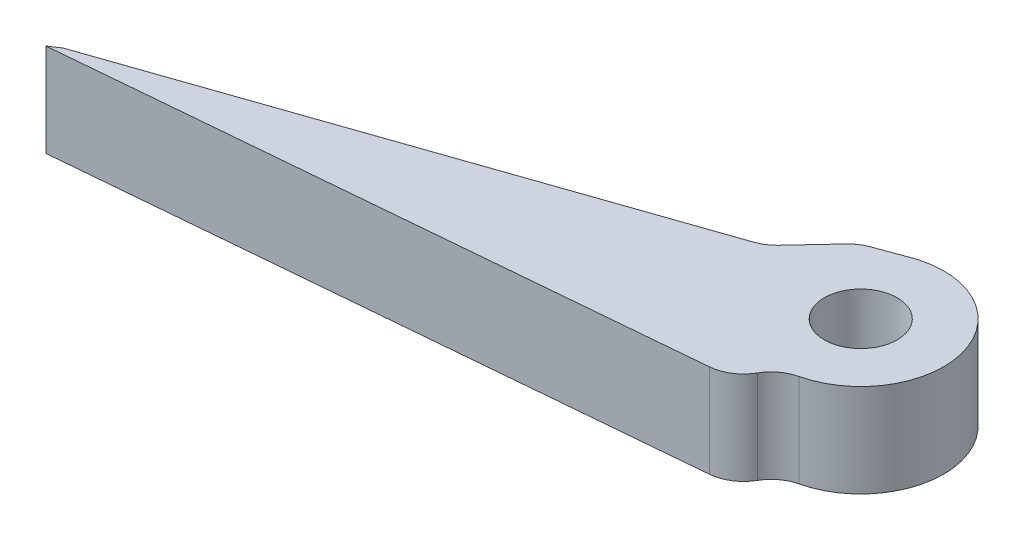
ISO-10303-21;
HEADER;
FILE_DESCRIPTION(('STEP AP214'),'2;1');
FILE_NAME('part.step','',(''),(''),'','','');
FILE_SCHEMA(('AUTOMOTIVE_DESIGN { 1 0 10303 214 1 1 1 1 }'));
ENDSEC;
DATA;
#1=APPLICATION_CONTEXT('core data for automotive mechanical design processes');
#2=APPLICATION_PROTOCOL_DEFINITION('international standard','automotive_design',2000,#1);
#3=PRODUCT_CONTEXT('',#1,'mechanical');
#4=PRODUCT('Part','Part','',(#3));
#5=PRODUCT_RELATED_PRODUCT_CATEGORY('part','',(#4));
#6=PRODUCT_DEFINITION_FORMATION('','',#4);
#7=PRODUCT_DEFINITION_CONTEXT('part definition',#1,'design');
#8=PRODUCT_DEFINITION('design','',#6,#7);
#9=PRODUCT_DEFINITION_SHAPE('','',#8);
#10=(LENGTH_UNIT() NAMED_UNIT(*) SI_UNIT(.MILLI.,.METRE.));
#11=(NAMED_UNIT(*) PLANE_ANGLE_UNIT() SI_UNIT($,.RADIAN.));
#12=(NAMED_UNIT(*) SI_UNIT($,.STERADIAN.) SOLID_ANGLE_UNIT());
#13=UNCERTAINTY_MEASURE_WITH_UNIT(LENGTH_MEASURE(1.E-05),#10,'distance_accuracy_value','');
#14=(GEOMETRIC_REPRESENTATION_CONTEXT(3) GLOBAL_UNCERTAINTY_ASSIGNED_CONTEXT((#13)) GLOBAL_UNIT_ASSIGNED_CONTEXT((#10,
#11,#12)) REPRESENTATION_CONTEXT('',''));
#15=CARTESIAN_POINT('',(0.,0.,0.));
#16=DIRECTION('',(0.,0.,1.));
#17=DIRECTION('',(1.,0.,0.));
#18=AXIS2_PLACEMENT_3D('',#15,#16,#17);
#19=CARTESIAN_POINT('',(0.,6.35,0.));
#20=DIRECTION('',(0.,-1.,0.));
#21=DIRECTION('',(0.,0.,-1.));
#22=AXIS2_PLACEMENT_3D('',#19,#20,#21);
#23=CYLINDRICAL_SURFACE('',#22,5.6642);
#24=CARTESIAN_POINT('',(0.,6.35,0.));
#25=DIRECTION('',(0.,1.,0.));
#26=DIRECTION('',(0.,0.,1.));
#27=AXIS2_PLACEMENT_3D('',#24,#25,#26);
#28=CIRCLE('',#27,5.6642);
#29=CARTESIAN_POINT('',(1.29689508505912,6.35,5.51373056816793));
#30=VERTEX_POINT('',#29);
#31=CARTESIAN_POINT('',(-1.48078407813982,6.35,-5.46721502722616));
#32=VERTEX_POINT('',#31);
#33=EDGE_CURVE('E190',#30,#32,#28,.T.);
#34=ORIENTED_EDGE('',*,*,#33,.F.);
#35=DIRECTION('',(0.,-1.,0.));
#36=VECTOR('',#35,1.);
#37=CARTESIAN_POINT('',(1.29689508505912,6.35,5.51373056816793));
#38=LINE('',#37,#36);
#39=CARTESIAN_POINT('',(1.29689508505912,0.,5.51373056816793));
#40=VERTEX_POINT('',#39);
#41=EDGE_CURVE('E240',#30,#40,#38,.T.);
#42=ORIENTED_EDGE('',*,*,#41,.T.);
#43=CARTESIAN_POINT('',(0.,0.,0.));
#44=DIRECTION('',(0.,1.,0.));
#45=DIRECTION('',(0.,0.,1.));
#46=AXIS2_PLACEMENT_3D('',#43,#44,#45);
#47=CIRCLE('',#46,5.6642);
#48=CARTESIAN_POINT('',(-1.48078407813982,0.,-5.46721502722616));
#49=VERTEX_POINT('',#48);
#50=EDGE_CURVE('E166',#40,#49,#47,.T.);
#51=ORIENTED_EDGE('',*,*,#50,.T.);
#52=DIRECTION('',(0.,-1.,0.));
#53=VECTOR('',#52,1.);
#54=CARTESIAN_POINT('',(-1.48078407813982,6.35,-5.46721502722616));
#55=LINE('',#54,#53);
#56=EDGE_CURVE('E221',#49,#32,#55,.F.);
#57=ORIENTED_EDGE('',*,*,#56,.T.);
#58=EDGE_LOOP('',(#34,#42,#51,#57));
#59=FACE_BOUND('',#58,.T.);
#60=ADVANCED_FACE('F42',(#59),#23,.T.);
#61=CARTESIAN_POINT('',(-1.93832585993717,6.35,-5.31007611663692));
#62=DIRECTION('',(0.342897302873058,0.,0.939372897034177));
#63=DIRECTION('',(0.939372897034177,0.,-0.342897302873058));
#64=AXIS2_PLACEMENT_3D('',#61,#62,#63);
#65=PLANE('',#64);
#66=DIRECTION('',(-0.939372897034177,0.,0.342897302873058));
#67=VECTOR('',#66,1.);
#68=CARTESIAN_POINT('',(-1.93832585993717,6.35,-5.31007611663692));
#69=LINE('',#68,#67);
#70=CARTESIAN_POINT('',(-1.68771449284554,6.35,-5.40155625420142));
#71=VERTEX_POINT('',#70);
#72=CARTESIAN_POINT('',(-3.93136501602205,6.35,-4.58256124655755));
#73=VERTEX_POINT('',#72);
#74=EDGE_CURVE('E261',#71,#73,#69,.T.);
#75=ORIENTED_EDGE('',*,*,#74,.F.);
#76=DIRECTION('',(0.,-1.,0.));
#77=VECTOR('',#76,1.);
#78=CARTESIAN_POINT('',(-1.68771449284554,6.35,-5.40155625420142));
#79=LINE('',#78,#77);
#80=CARTESIAN_POINT('',(-1.68771449284554,0.,-5.40155625420142));
#81=VERTEX_POINT('',#80);
#82=EDGE_CURVE('E217',#71,#81,#79,.T.);
#83=ORIENTED_EDGE('',*,*,#82,.T.);
#84=DIRECTION('',(-0.939372897034177,0.,0.342897302873058));
#85=VECTOR('',#84,1.);
#86=CARTESIAN_POINT('',(-1.93832585993717,0.,-5.31007611663692));
#87=LINE('',#86,#85);
#88=CARTESIAN_POINT('',(-3.93136501602205,0.,-4.58256124655755));
#89=VERTEX_POINT('',#88);
#90=EDGE_CURVE('E169',#81,#89,#87,.T.);
#91=ORIENTED_EDGE('',*,*,#90,.T.);
#92=DIRECTION('',(0.,-1.,0.));
#93=VECTOR('',#92,1.);
#94=CARTESIAN_POINT('',(-3.93136501602205,6.35,-4.58256124655755));
#95=LINE('',#94,#93);
#96=EDGE_CURVE('E214',#89,#73,#95,.F.);
#97=ORIENTED_EDGE('',*,*,#96,.T.);
#98=EDGE_LOOP('',(#75,#83,#91,#97));
#99=FACE_BOUND('',#98,.T.);
#100=ADVANCED_FACE('F264',(#99),#65,.F.);
#101=CARTESIAN_POINT('',(-4.58967507965529,6.35,-4.28088514702107));
#102=DIRECTION('',(0.731278684400195,0.,0.682078797311514));
#103=DIRECTION('',(0.682078797311514,0.,-0.731278684400195));
#104=AXIS2_PLACEMENT_3D('',#101,#102,#103);
#105=PLANE('',#104);
#106=DIRECTION('',(-0.682078797311514,0.,0.731278684400195));
#107=VECTOR('',#106,1.);
#108=CARTESIAN_POINT('',(-4.58967507965529,6.35,-4.28088514702107));
#109=LINE('',#108,#107);
#110=CARTESIAN_POINT('',(-4.91785372510097,6.35,-3.92903423326198));
#111=VERTEX_POINT('',#110);
#112=CARTESIAN_POINT('',(-7.13490656472734,6.35,-1.55206035546642));
#113=VERTEX_POINT('',#112);
#114=EDGE_CURVE('E139',#111,#113,#109,.T.);
#115=ORIENTED_EDGE('',*,*,#114,.F.);
#116=DIRECTION('',(0.,-1.,0.));
#117=VECTOR('',#116,1.);
#118=CARTESIAN_POINT('',(-4.91785372510097,6.35,-3.92903423326198));
#119=LINE('',#118,#117);
#120=CARTESIAN_POINT('',(-4.91785372510097,0.,-3.92903423326198));
#121=VERTEX_POINT('',#120);
#122=EDGE_CURVE('E228',#111,#121,#119,.T.);
#123=ORIENTED_EDGE('',*,*,#122,.T.);
#124=DIRECTION('',(-0.682078797311514,0.,0.731278684400195));
#125=VECTOR('',#124,1.);
#126=CARTESIAN_POINT('',(-4.58967507965529,0.,-4.28088514702107));
#127=LINE('',#126,#125);
#128=CARTESIAN_POINT('',(-7.13490656472734,0.,-1.55206035546642));
#129=VERTEX_POINT('',#128);
#130=EDGE_CURVE('E173',#121,#129,#127,.T.);
#131=ORIENTED_EDGE('',*,*,#130,.T.);
#132=DIRECTION('',(0.,-1.,0.));
#133=VECTOR('',#132,1.);
#134=CARTESIAN_POINT('',(-7.13490656472734,6.35,-1.55206035546642));
#135=LINE('',#134,#133);
#136=EDGE_CURVE('E225',#129,#113,#135,.F.);
#137=ORIENTED_EDGE('',*,*,#136,.T.);
#138=EDGE_LOOP('',(#115,#123,#131,#137));
#139=FACE_BOUND('',#138,.T.);
#140=ADVANCED_FACE('F293',(#139),#105,.F.);
#141=CARTESIAN_POINT('',(-1.14127849340694,6.35,-3.3070118596416));
#142=DIRECTION('',(0.326228149845985,0.,0.945291063243521));
#143=DIRECTION('',(0.945291063243521,0.,-0.326228149845985));
#144=AXIS2_PLACEMENT_3D('',#141,#142,#143);
#145=PLANE('',#144);
#146=DIRECTION('',(-0.945291063243521,0.,0.326228149845985));
#147=VECTOR('',#146,1.);
#148=CARTESIAN_POINT('',(-1.14127849340694,6.35,-3.3070118596416));
#149=LINE('',#148,#147);
#150=CARTESIAN_POINT('',(-8.16373492249503,6.35,-0.88350119999912));
#151=VERTEX_POINT('',#150);
#152=CARTESIAN_POINT('',(-43.2087752257035,6.35,11.2108463548856));
#153=VERTEX_POINT('',#152);
#154=EDGE_CURVE('E124',#151,#153,#149,.T.);
#155=ORIENTED_EDGE('',*,*,#154,.F.);
#156=DIRECTION('',(0.,-1.,0.));
#157=VECTOR('',#156,1.);
#158=CARTESIAN_POINT('',(-8.16373492249503,0.,-0.883501199999119));
#159=LINE('',#158,#157);
#160=CARTESIAN_POINT('',(-8.16373492249503,0.,-0.88350119999912));
#161=VERTEX_POINT('',#160);
#162=EDGE_CURVE('E232',#151,#161,#159,.T.);
#163=ORIENTED_EDGE('',*,*,#162,.T.);
#164=DIRECTION('',(-0.945291063243521,0.,0.326228149845985));
#165=VECTOR('',#164,1.);
#166=CARTESIAN_POINT('',(-1.14127849340694,0.,-3.3070118596416));
#167=LINE('',#166,#165);
#168=CARTESIAN_POINT('',(-43.2087752257035,0.,11.2108463548856));
#169=VERTEX_POINT('',#168);
#170=EDGE_CURVE('E145',#161,#169,#167,.T.);
#171=ORIENTED_EDGE('',*,*,#170,.T.);
#172=DIRECTION('',(0.,-1.,0.));
#173=VECTOR('',#172,1.);
#174=CARTESIAN_POINT('',(-43.2087752257035,6.35,11.2108463548856));
#175=LINE('',#174,#173);
#176=EDGE_CURVE('E142',#153,#169,#175,.T.);
#177=ORIENTED_EDGE('',*,*,#176,.F.);
#178=EDGE_LOOP('',(#155,#163,#171,#177));
#179=FACE_BOUND('',#178,.T.);
#180=ADVANCED_FACE('F143',(#179),#145,.F.);
#181=CARTESIAN_POINT('',(-8.12479474790291,6.35,-12.1842060856918));
#182=DIRECTION('',(0.554794299812511,0.,0.831987550925821));
#183=DIRECTION('',(0.831987550925821,0.,-0.554794299812511));
#184=AXIS2_PLACEMENT_3D('',#181,#182,#183);
#185=PLANE('',#184);
#186=DIRECTION('',(-0.831987550925821,0.,0.554794299812511));
#187=VECTOR('',#186,1.);
#188=CARTESIAN_POINT('',(-8.12479474790291,0.,-12.1842060856918));
#189=LINE('',#188,#187);
#190=CARTESIAN_POINT('',(-43.9079976591394,0.,11.6771088848232));
#191=VERTEX_POINT('',#190);
#192=EDGE_CURVE('E179',#169,#191,#189,.T.);
#193=ORIENTED_EDGE('',*,*,#192,.T.);
#194=DIRECTION('',(0.,-1.,0.));
#195=VECTOR('',#194,1.);
#196=CARTESIAN_POINT('',(-43.9079976591394,6.35,11.6771088848232));
#197=LINE('',#196,#195);
#198=CARTESIAN_POINT('',(-43.9079976591394,6.35,11.6771088848232));
#199=VERTEX_POINT('',#198);
#200=EDGE_CURVE('E150',#199,#191,#197,.T.);
#201=ORIENTED_EDGE('',*,*,#200,.F.);
#202=DIRECTION('',(-0.831987550925821,0.,0.554794299812511));
#203=VECTOR('',#202,1.);
#204=CARTESIAN_POINT('',(-8.12479474790291,6.35,-12.1842060856918));
#205=LINE('',#204,#203);
#206=EDGE_CURVE('E130',#153,#199,#205,.T.);
#207=ORIENTED_EDGE('',*,*,#206,.F.);
#208=ORIENTED_EDGE('',*,*,#176,.T.);
#209=EDGE_LOOP('',(#193,#201,#207,#208));
#210=FACE_BOUND('',#209,.T.);
#211=ADVANCED_FACE('F152',(#210),#185,.F.);
#212=CARTESIAN_POINT('',(0.684121339297338,6.35,7.73125035187185));
#213=DIRECTION('',(-0.0881433880829443,0.,-0.996107796946324));
#214=DIRECTION('',(-0.996107796946324,0.,0.0881433880829443));
#215=AXIS2_PLACEMENT_3D('',#212,#213,#214);
#216=PLANE('',#215);
#217=DIRECTION('',(0.996107796946324,0.,-0.0881433880829443));
#218=VECTOR('',#217,1.);
#219=CARTESIAN_POINT('',(0.684121339297338,0.,7.73125035187185));
#220=LINE('',#219,#218);
#221=CARTESIAN_POINT('',(-2.30836599064848,0.,7.99604897393396));
#222=VERTEX_POINT('',#221);
#223=EDGE_CURVE('E182',#191,#222,#220,.T.);
#224=ORIENTED_EDGE('',*,*,#223,.T.);
#225=DIRECTION('',(0.,-1.,0.));
#226=VECTOR('',#225,1.);
#227=CARTESIAN_POINT('',(-2.30836599064848,6.35,7.99604897393396));
#228=LINE('',#227,#226);
#229=CARTESIAN_POINT('',(-2.30836599064848,6.35,7.99604897393396));
#230=VERTEX_POINT('',#229);
#231=EDGE_CURVE('E202',#222,#230,#228,.F.);
#232=ORIENTED_EDGE('',*,*,#231,.T.);
#233=DIRECTION('',(0.996107796946324,0.,-0.0881433880829443));
#234=VECTOR('',#233,1.);
#235=CARTESIAN_POINT('',(0.684121339297338,6.35,7.73125035187185));
#236=LINE('',#235,#234);
#237=EDGE_CURVE('E156',#199,#230,#236,.T.);
#238=ORIENTED_EDGE('',*,*,#237,.F.);
#239=ORIENTED_EDGE('',*,*,#200,.T.);
#240=EDGE_LOOP('',(#224,#232,#238,#239));
#241=FACE_BOUND('',#240,.T.);
#242=ADVANCED_FACE('F280',(#241),#216,.F.);
#243=CARTESIAN_POINT('',(0.,6.35,0.));
#244=DIRECTION('',(0.,-1.,0.));
#245=DIRECTION('',(0.,0.,-1.));
#246=AXIS2_PLACEMENT_3D('',#243,#244,#245);
#247=CYLINDRICAL_SURFACE('',#246,2.4892);
#248=CARTESIAN_POINT('',(0.,6.35,0.));
#249=DIRECTION('',(0.,1.,0.));
#250=DIRECTION('',(0.,0.,1.));
#251=AXIS2_PLACEMENT_3D('',#248,#249,#250);
#252=CIRCLE('',#251,2.4892);
#253=CARTESIAN_POINT('',(0.,6.35,2.4892));
#254=VERTEX_POINT('',#253);
#255=EDGE_CURVE('E159',#254,#254,#252,.T.);
#256=ORIENTED_EDGE('',*,*,#255,.T.);
#257=EDGE_LOOP('',(#256));
#258=FACE_BOUND('',#257,.T.);
#259=CARTESIAN_POINT('',(0.,0.,0.));
#260=DIRECTION('',(0.,1.,0.));
#261=DIRECTION('',(0.,0.,1.));
#262=AXIS2_PLACEMENT_3D('',#259,#260,#261);
#263=CIRCLE('',#262,2.4892);
#264=CARTESIAN_POINT('',(0.,0.,2.4892));
#265=VERTEX_POINT('',#264);
#266=EDGE_CURVE('E186',#265,#265,#263,.T.);
#267=ORIENTED_EDGE('',*,*,#266,.F.);
#268=EDGE_LOOP('',(#267));
#269=FACE_BOUND('',#268,.T.);
#270=ADVANCED_FACE('F315',(#258,#269),#247,.F.);
#271=CARTESIAN_POINT('',(0.,6.35,0.));
#272=DIRECTION('',(0.,1.,0.));
#273=DIRECTION('',(0.,0.,1.));
#274=AXIS2_PLACEMENT_3D('',#271,#272,#273);
#275=PLANE('',#274);
#276=ORIENTED_EDGE('',*,*,#237,.T.);
#277=CARTESIAN_POINT('',(-2.53225019637915,6.35,5.46593516969029));
#278=DIRECTION('',(0.,1.,0.));
#279=DIRECTION('',(0.,0.,1.));
#280=AXIS2_PLACEMENT_3D('',#277,#278,#279);
#281=CIRCLE('',#280,2.54);
#282=CARTESIAN_POINT('',(-0.326893904301469,6.35,6.72609532815959));
#283=VERTEX_POINT('',#282);
#284=EDGE_CURVE('E211',#230,#283,#281,.T.);
#285=ORIENTED_EDGE('',*,*,#284,.T.);
#286=CARTESIAN_POINT('',(1.87846238777622,6.35,7.98625548662889));
#287=DIRECTION('',(0.,1.,0.));
#288=DIRECTION('',(0.,0.,1.));
#289=AXIS2_PLACEMENT_3D('',#286,#287,#288);
#290=CIRCLE('',#289,2.54);
#291=EDGE_CURVE('E11',#283,#30,#290,.F.);
#292=ORIENTED_EDGE('',*,*,#291,.T.);
#293=ORIENTED_EDGE('',*,*,#33,.T.);
#294=CARTESIAN_POINT('',(-0.816755343547975,6.35,-3.01554909573461));
#295=DIRECTION('',(0.,1.,0.));
#296=DIRECTION('',(0.,0.,1.));
#297=AXIS2_PLACEMENT_3D('',#294,#295,#296);
#298=CIRCLE('',#297,2.54);
#299=EDGE_CURVE('E208',#32,#71,#298,.T.);
#300=ORIENTED_EDGE('',*,*,#299,.T.);
#301=ORIENTED_EDGE('',*,*,#74,.T.);
#302=CARTESIAN_POINT('',(-3.06040586672448,6.35,-2.19655408809074));
#303=DIRECTION('',(0.,1.,0.));
#304=DIRECTION('',(0.,0.,1.));
#305=AXIS2_PLACEMENT_3D('',#302,#303,#304);
#306=CIRCLE('',#305,2.54);
#307=EDGE_CURVE('E205',#73,#111,#306,.T.);
#308=ORIENTED_EDGE('',*,*,#307,.T.);
#309=ORIENTED_EDGE('',*,*,#114,.T.);
#310=CARTESIAN_POINT('',(-8.99235442310383,6.35,-3.28454050063766));
#311=DIRECTION('',(0.,1.,0.));
#312=DIRECTION('',(0.,0.,1.));
#313=AXIS2_PLACEMENT_3D('',#310,#311,#312);
#314=CIRCLE('',#313,2.54);
#315=EDGE_CURVE('E134',#113,#151,#314,.F.);
#316=ORIENTED_EDGE('',*,*,#315,.T.);
#317=ORIENTED_EDGE('',*,*,#154,.T.);
#318=ORIENTED_EDGE('',*,*,#206,.T.);
#319=EDGE_LOOP('',(#276,#285,#292,#293,#300,#301,#308,#309,#316,#317,#318));
#320=FACE_BOUND('',#319,.T.);
#321=ORIENTED_EDGE('',*,*,#255,.F.);
#322=EDGE_LOOP('',(#321));
#323=FACE_BOUND('',#322,.T.);
#324=ADVANCED_FACE('F127',(#320,#323),#275,.T.);
#325=CARTESIAN_POINT('',(0.,0.,0.));
#326=DIRECTION('',(0.,1.,0.));
#327=DIRECTION('',(0.,0.,1.));
#328=AXIS2_PLACEMENT_3D('',#325,#326,#327);
#329=PLANE('',#328);
#330=ORIENTED_EDGE('',*,*,#50,.F.);
#331=CARTESIAN_POINT('',(1.87846238777622,0.,7.98625548662889));
#332=DIRECTION('',(0.,1.,0.));
#333=DIRECTION('',(0.,0.,1.));
#334=AXIS2_PLACEMENT_3D('',#331,#332,#333);
#335=CIRCLE('',#334,2.54);
#336=CARTESIAN_POINT('',(-0.326893904301469,0.,6.72609532815959));
#337=VERTEX_POINT('',#336);
#338=EDGE_CURVE('E51',#40,#337,#335,.T.);
#339=ORIENTED_EDGE('',*,*,#338,.T.);
#340=CARTESIAN_POINT('',(-2.53225019637915,0.,5.46593516969029));
#341=DIRECTION('',(0.,1.,0.));
#342=DIRECTION('',(0.,0.,1.));
#343=AXIS2_PLACEMENT_3D('',#340,#341,#342);
#344=CIRCLE('',#343,2.54);
#345=EDGE_CURVE('E199',#337,#222,#344,.F.);
#346=ORIENTED_EDGE('',*,*,#345,.T.);
#347=ORIENTED_EDGE('',*,*,#223,.F.);
#348=ORIENTED_EDGE('',*,*,#192,.F.);
#349=ORIENTED_EDGE('',*,*,#170,.F.);
#350=CARTESIAN_POINT('',(-8.99235442310383,0.,-3.28454050063766));
#351=DIRECTION('',(0.,1.,0.));
#352=DIRECTION('',(0.,0.,1.));
#353=AXIS2_PLACEMENT_3D('',#350,#351,#352);
#354=CIRCLE('',#353,2.54);
#355=EDGE_CURVE('E235',#161,#129,#354,.T.);
#356=ORIENTED_EDGE('',*,*,#355,.T.);
#357=ORIENTED_EDGE('',*,*,#130,.F.);
#358=CARTESIAN_POINT('',(-3.06040586672448,0.,-2.19655408809074));
#359=DIRECTION('',(0.,1.,0.));
#360=DIRECTION('',(0.,0.,1.));
#361=AXIS2_PLACEMENT_3D('',#358,#359,#360);
#362=CIRCLE('',#361,2.54);
#363=EDGE_CURVE('E149',#121,#89,#362,.F.);
#364=ORIENTED_EDGE('',*,*,#363,.T.);
#365=ORIENTED_EDGE('',*,*,#90,.F.);
#366=CARTESIAN_POINT('',(-0.816755343547975,0.,-3.01554909573461));
#367=DIRECTION('',(0.,1.,0.));
#368=DIRECTION('',(0.,0.,1.));
#369=AXIS2_PLACEMENT_3D('',#366,#367,#368);
#370=CIRCLE('',#369,2.54);
#371=EDGE_CURVE('E195',#81,#49,#370,.F.);
#372=ORIENTED_EDGE('',*,*,#371,.T.);
#373=EDGE_LOOP('',(#330,#339,#346,#347,#348,#349,#356,#357,#364,#365,#372));
#374=FACE_BOUND('',#373,.T.);
#375=ORIENTED_EDGE('',*,*,#266,.T.);
#376=EDGE_LOOP('',(#375));
#377=FACE_BOUND('',#376,.T.);
#378=ADVANCED_FACE('F251',(#374,#377),#329,.F.);
#379=CARTESIAN_POINT('',(-2.53225019637915,6.35,5.46593516969029));
#380=DIRECTION('',(0.,-1.,0.));
#381=DIRECTION('',(0.,0.,-1.));
#382=AXIS2_PLACEMENT_3D('',#379,#380,#381);
#383=CYLINDRICAL_SURFACE('',#382,2.54);
#384=ORIENTED_EDGE('',*,*,#345,.F.);
#385=DIRECTION('',(0.,-1.,0.));
#386=VECTOR('',#385,1.);
#387=CARTESIAN_POINT('',(-0.326893904301469,6.35,6.72609532815959));
#388=LINE('',#387,#386);
#389=EDGE_CURVE('E64',#337,#283,#388,.F.);
#390=ORIENTED_EDGE('',*,*,#389,.T.);
#391=ORIENTED_EDGE('',*,*,#284,.F.);
#392=ORIENTED_EDGE('',*,*,#231,.F.);
#393=EDGE_LOOP('',(#384,#390,#391,#392));
#394=FACE_BOUND('',#393,.T.);
#395=ADVANCED_FACE('F282',(#394),#383,.T.);
#396=CARTESIAN_POINT('',(-0.816755343547975,6.35,-3.01554909573461));
#397=DIRECTION('',(0.,-1.,0.));
#398=DIRECTION('',(0.,0.,-1.));
#399=AXIS2_PLACEMENT_3D('',#396,#397,#398);
#400=CYLINDRICAL_SURFACE('',#399,2.54);
#401=ORIENTED_EDGE('',*,*,#299,.F.);
#402=ORIENTED_EDGE('',*,*,#56,.F.);
#403=ORIENTED_EDGE('',*,*,#371,.F.);
#404=ORIENTED_EDGE('',*,*,#82,.F.);
#405=EDGE_LOOP('',(#401,#402,#403,#404));
#406=FACE_BOUND('',#405,.T.);
#407=ADVANCED_FACE('F258',(#406),#400,.T.);
#408=CARTESIAN_POINT('',(-3.06040586672448,6.35,-2.19655408809074));
#409=DIRECTION('',(0.,-1.,0.));
#410=DIRECTION('',(0.,0.,-1.));
#411=AXIS2_PLACEMENT_3D('',#408,#409,#410);
#412=CYLINDRICAL_SURFACE('',#411,2.54);
#413=ORIENTED_EDGE('',*,*,#307,.F.);
#414=ORIENTED_EDGE('',*,*,#96,.F.);
#415=ORIENTED_EDGE('',*,*,#363,.F.);
#416=ORIENTED_EDGE('',*,*,#122,.F.);
#417=EDGE_LOOP('',(#413,#414,#415,#416));
#418=FACE_BOUND('',#417,.T.);
#419=ADVANCED_FACE('F287',(#418),#412,.T.);
#420=CARTESIAN_POINT('',(-8.99235442310383,6.35,-3.28454050063766));
#421=DIRECTION('',(0.,1.,0.));
#422=DIRECTION('',(0.,0.,1.));
#423=AXIS2_PLACEMENT_3D('',#420,#421,#422);
#424=CYLINDRICAL_SURFACE('',#423,2.54);
#425=ORIENTED_EDGE('',*,*,#315,.F.);
#426=ORIENTED_EDGE('',*,*,#136,.F.);
#427=ORIENTED_EDGE('',*,*,#355,.F.);
#428=ORIENTED_EDGE('',*,*,#162,.F.);
#429=EDGE_LOOP('',(#425,#426,#427,#428));
#430=FACE_BOUND('',#429,.T.);
#431=ADVANCED_FACE('F276',(#430),#424,.F.);
#432=CARTESIAN_POINT('',(1.87846238777622,6.35,7.98625548662889));
#433=DIRECTION('',(0.,1.,0.));
#434=DIRECTION('',(0.,0.,1.));
#435=AXIS2_PLACEMENT_3D('',#432,#433,#434);
#436=CYLINDRICAL_SURFACE('',#435,2.54);
#437=ORIENTED_EDGE('',*,*,#291,.F.);
#438=ORIENTED_EDGE('',*,*,#389,.F.);
#439=ORIENTED_EDGE('',*,*,#338,.F.);
#440=ORIENTED_EDGE('',*,*,#41,.F.);
#441=EDGE_LOOP('',(#437,#438,#439,#440));
#442=FACE_BOUND('',#441,.T.);
#443=ADVANCED_FACE('F44',(#442),#436,.F.);
#444=CLOSED_SHELL('',(#60,#100,#140,#180,#211,#242,#270,#324,#378,#395,#407,#419,#431,#443));
#445=MANIFOLD_SOLID_BREP('B2',#444);
#446=ADVANCED_BREP_SHAPE_REPRESENTATION('',(#18,#445),#14);
#447=SHAPE_DEFINITION_REPRESENTATION(#9,#446);
ENDSEC;
END-ISO-10303-21;
